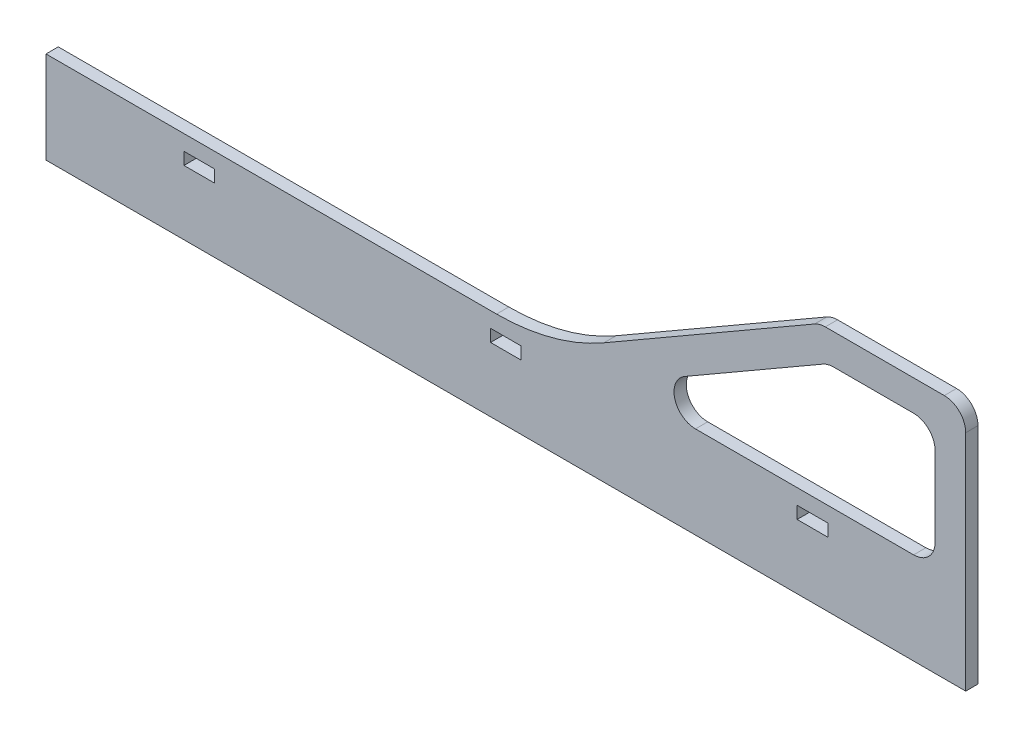
ISO-10303-21;
HEADER;
FILE_DESCRIPTION(('STEP AP214'),'2;1');
FILE_NAME('part.step','',(''),(''),'','','');
FILE_SCHEMA(('AUTOMOTIVE_DESIGN { 1 0 10303 214 1 1 1 1 }'));
ENDSEC;
DATA;
#1=APPLICATION_CONTEXT('core data for automotive mechanical design processes');
#2=APPLICATION_PROTOCOL_DEFINITION('international standard','automotive_design',2000,#1);
#3=PRODUCT_CONTEXT('',#1,'mechanical');
#4=PRODUCT('Part','Part','',(#3));
#5=PRODUCT_RELATED_PRODUCT_CATEGORY('part','',(#4));
#6=PRODUCT_DEFINITION_FORMATION('','',#4);
#7=PRODUCT_DEFINITION_CONTEXT('part definition',#1,'design');
#8=PRODUCT_DEFINITION('design','',#6,#7);
#9=PRODUCT_DEFINITION_SHAPE('','',#8);
#10=(LENGTH_UNIT() NAMED_UNIT(*) SI_UNIT(.MILLI.,.METRE.));
#11=(NAMED_UNIT(*) PLANE_ANGLE_UNIT() SI_UNIT($,.RADIAN.));
#12=(NAMED_UNIT(*) SI_UNIT($,.STERADIAN.) SOLID_ANGLE_UNIT());
#13=UNCERTAINTY_MEASURE_WITH_UNIT(LENGTH_MEASURE(1.E-05),#10,'distance_accuracy_value','');
#14=(GEOMETRIC_REPRESENTATION_CONTEXT(3) GLOBAL_UNCERTAINTY_ASSIGNED_CONTEXT((#13)) GLOBAL_UNIT_ASSIGNED_CONTEXT((#10,
#11,#12)) REPRESENTATION_CONTEXT('',''));
#15=CARTESIAN_POINT('',(0.,0.,0.));
#16=DIRECTION('',(0.,0.,1.));
#17=DIRECTION('',(1.,0.,0.));
#18=AXIS2_PLACEMENT_3D('',#15,#16,#17);
#19=CARTESIAN_POINT('',(546.959107885458,100.,4.));
#20=DIRECTION('',(0.,0.,-1.));
#21=DIRECTION('',(-1.,0.,0.));
#22=AXIS2_PLACEMENT_3D('',#19,#20,#21);
#23=PLANE('',#22);
#24=DIRECTION('',(0.,-1.,0.));
#25=VECTOR('',#24,1.);
#26=CARTESIAN_POINT('',(645.,21.,4.));
#27=LINE('',#26,#25);
#28=CARTESIAN_POINT('',(645.,25.0000000000028,4.));
#29=VERTEX_POINT('',#28);
#30=CARTESIAN_POINT('',(645.,21.,4.));
#31=VERTEX_POINT('',#30);
#32=EDGE_CURVE('E288',#29,#31,#27,.T.);
#33=ORIENTED_EDGE('',*,*,#32,.F.);
#34=DIRECTION('',(-1.,0.,0.));
#35=VECTOR('',#34,1.);
#36=CARTESIAN_POINT('',(645.,25.0000000000028,4.));
#37=LINE('',#36,#35);
#38=CARTESIAN_POINT('',(655.,25.0000000000028,4.));
#39=VERTEX_POINT('',#38);
#40=EDGE_CURVE('E296',#39,#29,#37,.T.);
#41=ORIENTED_EDGE('',*,*,#40,.F.);
#42=DIRECTION('',(0.,1.,0.));
#43=VECTOR('',#42,1.);
#44=CARTESIAN_POINT('',(655.,21.,4.));
#45=LINE('',#44,#43);
#46=CARTESIAN_POINT('',(655.,21.,4.));
#47=VERTEX_POINT('',#46);
#48=EDGE_CURVE('E293',#47,#39,#45,.T.);
#49=ORIENTED_EDGE('',*,*,#48,.F.);
#50=DIRECTION('',(1.,0.,0.));
#51=VECTOR('',#50,1.);
#52=CARTESIAN_POINT('',(645.,21.,4.));
#53=LINE('',#52,#51);
#54=EDGE_CURVE('E290',#31,#47,#53,.T.);
#55=ORIENTED_EDGE('',*,*,#54,.F.);
#56=EDGE_LOOP('',(#33,#41,#49,#55));
#57=FACE_BOUND('',#56,.T.);
#58=DIRECTION('',(0.,-1.,0.));
#59=VECTOR('',#58,1.);
#60=CARTESIAN_POINT('',(445.,21.,4.));
#61=LINE('',#60,#59);
#62=CARTESIAN_POINT('',(445.,25.,4.));
#63=VERTEX_POINT('',#62);
#64=CARTESIAN_POINT('',(445.,21.,4.));
#65=VERTEX_POINT('',#64);
#66=EDGE_CURVE('E350',#63,#65,#61,.T.);
#67=ORIENTED_EDGE('',*,*,#66,.F.);
#68=DIRECTION('',(-1.,0.,0.));
#69=VECTOR('',#68,1.);
#70=CARTESIAN_POINT('',(445.,25.,4.));
#71=LINE('',#70,#69);
#72=CARTESIAN_POINT('',(455.,25.,4.));
#73=VERTEX_POINT('',#72);
#74=EDGE_CURVE('E358',#73,#63,#71,.T.);
#75=ORIENTED_EDGE('',*,*,#74,.F.);
#76=DIRECTION('',(0.,1.,0.));
#77=VECTOR('',#76,1.);
#78=CARTESIAN_POINT('',(455.,21.,4.));
#79=LINE('',#78,#77);
#80=CARTESIAN_POINT('',(455.,21.,4.));
#81=VERTEX_POINT('',#80);
#82=EDGE_CURVE('E355',#81,#73,#79,.T.);
#83=ORIENTED_EDGE('',*,*,#82,.F.);
#84=DIRECTION('',(1.,0.,0.));
#85=VECTOR('',#84,1.);
#86=CARTESIAN_POINT('',(445.,21.,4.));
#87=LINE('',#86,#85);
#88=EDGE_CURVE('E352',#65,#81,#87,.T.);
#89=ORIENTED_EDGE('',*,*,#88,.F.);
#90=EDGE_LOOP('',(#67,#75,#83,#89));
#91=FACE_BOUND('',#90,.T.);
#92=DIRECTION('',(0.,1.,0.));
#93=VECTOR('',#92,1.);
#94=CARTESIAN_POINT('',(700.,73.,4.));
#95=LINE('',#94,#93);
#96=CARTESIAN_POINT('',(700.,0.,4.));
#97=VERTEX_POINT('',#96);
#98=CARTESIAN_POINT('',(700.,73.,4.));
#99=VERTEX_POINT('',#98);
#100=EDGE_CURVE('E381',#97,#99,#95,.T.);
#101=ORIENTED_EDGE('',*,*,#100,.T.);
#102=CARTESIAN_POINT('',(693.,73.,4.));
#103=DIRECTION('',(0.,0.,1.));
#104=DIRECTION('',(-1.,0.,0.));
#105=AXIS2_PLACEMENT_3D('',#102,#103,#104);
#106=CIRCLE('',#105,7.00000000000001);
#107=CARTESIAN_POINT('',(693.,80.,4.));
#108=VERTEX_POINT('',#107);
#109=EDGE_CURVE('E384',#99,#108,#106,.T.);
#110=ORIENTED_EDGE('',*,*,#109,.T.);
#111=DIRECTION('',(-1.,0.,0.));
#112=VECTOR('',#111,1.);
#113=CARTESIAN_POINT('',(654.193736081099,80.,4.));
#114=LINE('',#113,#112);
#115=CARTESIAN_POINT('',(654.193736081099,80.,4.));
#116=VERTEX_POINT('',#115);
#117=EDGE_CURVE('E387',#108,#116,#114,.T.);
#118=ORIENTED_EDGE('',*,*,#117,.T.);
#119=CARTESIAN_POINT('',(654.193736081099,73.,4.));
#120=DIRECTION('',(0.,0.,1.));
#121=DIRECTION('',(1.,0.,0.));
#122=AXIS2_PLACEMENT_3D('',#119,#120,#121);
#123=CIRCLE('',#122,7.);
#124=CARTESIAN_POINT('',(650.693736081099,79.0621778264911,4.));
#125=VERTEX_POINT('',#124);
#126=EDGE_CURVE('E389',#116,#125,#123,.T.);
#127=ORIENTED_EDGE('',*,*,#126,.T.);
#128=DIRECTION('',(-0.866025403784442,-0.499999999999995,0.));
#129=VECTOR('',#128,1.);
#130=CARTESIAN_POINT('',(650.693736081099,79.0621778264911,4.));
#131=LINE('',#130,#129);
#132=CARTESIAN_POINT('',(581.959107885458,39.3782217350892,4.));
#133=VERTEX_POINT('',#132);
#134=EDGE_CURVE('E391',#125,#133,#131,.T.);
#135=ORIENTED_EDGE('',*,*,#134,.T.);
#136=CARTESIAN_POINT('',(546.959107885458,100.,4.));
#137=DIRECTION('',(0.,0.,-1.));
#138=DIRECTION('',(-1.,0.,0.));
#139=AXIS2_PLACEMENT_3D('',#136,#137,#138);
#140=CIRCLE('',#139,70.);
#141=CARTESIAN_POINT('',(546.959107885458,30.,4.));
#142=VERTEX_POINT('',#141);
#143=EDGE_CURVE('E393',#133,#142,#140,.T.);
#144=ORIENTED_EDGE('',*,*,#143,.T.);
#145=DIRECTION('',(-1.,0.,0.));
#146=VECTOR('',#145,1.);
#147=CARTESIAN_POINT('',(400.,30.,4.));
#148=LINE('',#147,#146);
#149=CARTESIAN_POINT('',(400.,30.,4.));
#150=VERTEX_POINT('',#149);
#151=EDGE_CURVE('E395',#142,#150,#148,.T.);
#152=ORIENTED_EDGE('',*,*,#151,.T.);
#153=DIRECTION('',(0.,-1.,0.));
#154=VECTOR('',#153,1.);
#155=CARTESIAN_POINT('',(400.,30.,4.));
#156=LINE('',#155,#154);
#157=CARTESIAN_POINT('',(400.,0.,4.));
#158=VERTEX_POINT('',#157);
#159=EDGE_CURVE('E397',#150,#158,#156,.T.);
#160=ORIENTED_EDGE('',*,*,#159,.T.);
#161=DIRECTION('',(1.,0.,0.));
#162=VECTOR('',#161,1.);
#163=CARTESIAN_POINT('',(400.,0.,4.));
#164=LINE('',#163,#162);
#165=EDGE_CURVE('E399',#158,#97,#164,.T.);
#166=ORIENTED_EDGE('',*,*,#165,.T.);
#167=EDGE_LOOP('',(#101,#110,#118,#127,#135,#144,#152,#160,#166));
#168=FACE_BOUND('',#167,.T.);
#169=DIRECTION('',(0.,-1.,0.));
#170=VECTOR('',#169,1.);
#171=CARTESIAN_POINT('',(545.,21.,4.));
#172=LINE('',#171,#170);
#173=CARTESIAN_POINT('',(545.,25.0000000000028,4.));
#174=VERTEX_POINT('',#173);
#175=CARTESIAN_POINT('',(545.,21.,4.));
#176=VERTEX_POINT('',#175);
#177=EDGE_CURVE('E319',#174,#176,#172,.T.);
#178=ORIENTED_EDGE('',*,*,#177,.F.);
#179=DIRECTION('',(-1.,0.,0.));
#180=VECTOR('',#179,1.);
#181=CARTESIAN_POINT('',(545.,25.0000000000028,4.));
#182=LINE('',#181,#180);
#183=CARTESIAN_POINT('',(555.,25.0000000000028,4.));
#184=VERTEX_POINT('',#183);
#185=EDGE_CURVE('E327',#184,#174,#182,.T.);
#186=ORIENTED_EDGE('',*,*,#185,.F.);
#187=DIRECTION('',(0.,1.,0.));
#188=VECTOR('',#187,1.);
#189=CARTESIAN_POINT('',(555.,21.,4.));
#190=LINE('',#189,#188);
#191=CARTESIAN_POINT('',(555.,21.,4.));
#192=VERTEX_POINT('',#191);
#193=EDGE_CURVE('E324',#192,#184,#190,.T.);
#194=ORIENTED_EDGE('',*,*,#193,.F.);
#195=DIRECTION('',(1.,0.,0.));
#196=VECTOR('',#195,1.);
#197=CARTESIAN_POINT('',(545.,21.,4.));
#198=LINE('',#197,#196);
#199=EDGE_CURVE('E321',#176,#192,#198,.T.);
#200=ORIENTED_EDGE('',*,*,#199,.F.);
#201=EDGE_LOOP('',(#178,#186,#194,#200));
#202=FACE_BOUND('',#201,.T.);
#203=CARTESIAN_POINT('',(611.839907008619,37.,4.));
#204=DIRECTION('',(0.,0.,1.));
#205=DIRECTION('',(-1.,0.,0.));
#206=AXIS2_PLACEMENT_3D('',#203,#204,#205);
#207=CIRCLE('',#206,6.99999999999999);
#208=CARTESIAN_POINT('',(608.33990700862,43.0621778264913,4.));
#209=VERTEX_POINT('',#208);
#210=CARTESIAN_POINT('',(611.83990700862,30.,4.));
#211=VERTEX_POINT('',#210);
#212=EDGE_CURVE('E223',#209,#211,#207,.T.);
#213=ORIENTED_EDGE('',*,*,#212,.F.);
#214=DIRECTION('',(-0.866025403784442,-0.499999999999995,0.));
#215=VECTOR('',#214,1.);
#216=CARTESIAN_POINT('',(653.373228005411,69.0621778264911,4.));
#217=LINE('',#216,#215);
#218=CARTESIAN_POINT('',(653.373228005411,69.0621778264911,4.));
#219=VERTEX_POINT('',#218);
#220=EDGE_CURVE('E256',#219,#209,#217,.T.);
#221=ORIENTED_EDGE('',*,*,#220,.F.);
#222=CARTESIAN_POINT('',(656.873228005411,63.,4.));
#223=DIRECTION('',(0.,0.,1.));
#224=DIRECTION('',(1.,0.,0.));
#225=AXIS2_PLACEMENT_3D('',#222,#223,#224);
#226=CIRCLE('',#225,7.);
#227=CARTESIAN_POINT('',(656.873228005411,70.,4.));
#228=VERTEX_POINT('',#227);
#229=EDGE_CURVE('E254',#228,#219,#226,.T.);
#230=ORIENTED_EDGE('',*,*,#229,.F.);
#231=DIRECTION('',(-1.,0.,0.));
#232=VECTOR('',#231,1.);
#233=CARTESIAN_POINT('',(656.873228005411,70.,4.));
#234=LINE('',#233,#232);
#235=CARTESIAN_POINT('',(683.,70.,4.));
#236=VERTEX_POINT('',#235);
#237=EDGE_CURVE('E252',#236,#228,#234,.T.);
#238=ORIENTED_EDGE('',*,*,#237,.F.);
#239=CARTESIAN_POINT('',(683.,63.,4.));
#240=DIRECTION('',(0.,0.,1.));
#241=DIRECTION('',(1.,0.,0.));
#242=AXIS2_PLACEMENT_3D('',#239,#240,#241);
#243=CIRCLE('',#242,7.00000000000001);
#244=CARTESIAN_POINT('',(690.,63.,4.));
#245=VERTEX_POINT('',#244);
#246=EDGE_CURVE('E250',#245,#236,#243,.T.);
#247=ORIENTED_EDGE('',*,*,#246,.F.);
#248=DIRECTION('',(0.,1.,0.));
#249=VECTOR('',#248,1.);
#250=CARTESIAN_POINT('',(690.,63.,4.));
#251=LINE('',#250,#249);
#252=CARTESIAN_POINT('',(690.,37.,4.));
#253=VERTEX_POINT('',#252);
#254=EDGE_CURVE('E246',#253,#245,#251,.T.);
#255=ORIENTED_EDGE('',*,*,#254,.F.);
#256=CARTESIAN_POINT('',(683.,37.,4.));
#257=DIRECTION('',(0.,0.,1.));
#258=DIRECTION('',(1.,0.,0.));
#259=AXIS2_PLACEMENT_3D('',#256,#257,#258);
#260=CIRCLE('',#259,7.);
#261=CARTESIAN_POINT('',(683.,30.,4.));
#262=VERTEX_POINT('',#261);
#263=EDGE_CURVE('E244',#262,#253,#260,.T.);
#264=ORIENTED_EDGE('',*,*,#263,.F.);
#265=DIRECTION('',(1.,0.,0.));
#266=VECTOR('',#265,1.);
#267=CARTESIAN_POINT('',(611.83990700862,30.,4.));
#268=LINE('',#267,#266);
#269=EDGE_CURVE('E231',#211,#262,#268,.T.);
#270=ORIENTED_EDGE('',*,*,#269,.F.);
#271=EDGE_LOOP('',(#213,#221,#230,#238,#247,#255,#264,#270));
#272=FACE_BOUND('',#271,.T.);
#273=ADVANCED_FACE('F32',(#57,#91,#168,#202,#272),#23,.F.);
#274=CARTESIAN_POINT('',(546.959107885458,100.,0.));
#275=DIRECTION('',(0.,0.,-1.));
#276=DIRECTION('',(-1.,0.,0.));
#277=AXIS2_PLACEMENT_3D('',#274,#275,#276);
#278=PLANE('',#277);
#279=DIRECTION('',(-1.,0.,0.));
#280=VECTOR('',#279,1.);
#281=CARTESIAN_POINT('',(645.,25.0000000000028,0.));
#282=LINE('',#281,#280);
#283=CARTESIAN_POINT('',(655.,25.0000000000028,0.));
#284=VERTEX_POINT('',#283);
#285=CARTESIAN_POINT('',(645.,25.0000000000028,0.));
#286=VERTEX_POINT('',#285);
#287=EDGE_CURVE('E291',#284,#286,#282,.T.);
#288=ORIENTED_EDGE('',*,*,#287,.T.);
#289=DIRECTION('',(0.,-1.,0.));
#290=VECTOR('',#289,1.);
#291=CARTESIAN_POINT('',(645.,21.,0.));
#292=LINE('',#291,#290);
#293=CARTESIAN_POINT('',(645.,21.,0.));
#294=VERTEX_POINT('',#293);
#295=EDGE_CURVE('E239',#286,#294,#292,.T.);
#296=ORIENTED_EDGE('',*,*,#295,.T.);
#297=DIRECTION('',(1.,0.,0.));
#298=VECTOR('',#297,1.);
#299=CARTESIAN_POINT('',(645.,21.,0.));
#300=LINE('',#299,#298);
#301=CARTESIAN_POINT('',(655.,21.,0.));
#302=VERTEX_POINT('',#301);
#303=EDGE_CURVE('E301',#294,#302,#300,.T.);
#304=ORIENTED_EDGE('',*,*,#303,.T.);
#305=DIRECTION('',(0.,1.,0.));
#306=VECTOR('',#305,1.);
#307=CARTESIAN_POINT('',(655.,21.,0.));
#308=LINE('',#307,#306);
#309=EDGE_CURVE('E304',#302,#284,#308,.T.);
#310=ORIENTED_EDGE('',*,*,#309,.T.);
#311=EDGE_LOOP('',(#288,#296,#304,#310));
#312=FACE_BOUND('',#311,.T.);
#313=DIRECTION('',(-1.,0.,0.));
#314=VECTOR('',#313,1.);
#315=CARTESIAN_POINT('',(445.,25.,0.));
#316=LINE('',#315,#314);
#317=CARTESIAN_POINT('',(455.,25.,0.));
#318=VERTEX_POINT('',#317);
#319=CARTESIAN_POINT('',(445.,25.,0.));
#320=VERTEX_POINT('',#319);
#321=EDGE_CURVE('E353',#318,#320,#316,.T.);
#322=ORIENTED_EDGE('',*,*,#321,.T.);
#323=DIRECTION('',(0.,-1.,0.));
#324=VECTOR('',#323,1.);
#325=CARTESIAN_POINT('',(445.,21.,0.));
#326=LINE('',#325,#324);
#327=CARTESIAN_POINT('',(445.,21.,0.));
#328=VERTEX_POINT('',#327);
#329=EDGE_CURVE('E349',#320,#328,#326,.T.);
#330=ORIENTED_EDGE('',*,*,#329,.T.);
#331=DIRECTION('',(1.,0.,0.));
#332=VECTOR('',#331,1.);
#333=CARTESIAN_POINT('',(445.,21.,0.));
#334=LINE('',#333,#332);
#335=CARTESIAN_POINT('',(455.,21.,0.));
#336=VERTEX_POINT('',#335);
#337=EDGE_CURVE('E363',#328,#336,#334,.T.);
#338=ORIENTED_EDGE('',*,*,#337,.T.);
#339=DIRECTION('',(0.,1.,0.));
#340=VECTOR('',#339,1.);
#341=CARTESIAN_POINT('',(455.,21.,0.));
#342=LINE('',#341,#340);
#343=EDGE_CURVE('E366',#336,#318,#342,.T.);
#344=ORIENTED_EDGE('',*,*,#343,.T.);
#345=EDGE_LOOP('',(#322,#330,#338,#344));
#346=FACE_BOUND('',#345,.T.);
#347=CARTESIAN_POINT('',(693.,73.,0.));
#348=DIRECTION('',(0.,0.,1.));
#349=DIRECTION('',(-1.,0.,0.));
#350=AXIS2_PLACEMENT_3D('',#347,#348,#349);
#351=CIRCLE('',#350,7.00000000000001);
#352=CARTESIAN_POINT('',(700.,73.,0.));
#353=VERTEX_POINT('',#352);
#354=CARTESIAN_POINT('',(693.,80.,0.));
#355=VERTEX_POINT('',#354);
#356=EDGE_CURVE('E380',#353,#355,#351,.T.);
#357=ORIENTED_EDGE('',*,*,#356,.F.);
#358=DIRECTION('',(0.,1.,0.));
#359=VECTOR('',#358,1.);
#360=CARTESIAN_POINT('',(700.,0.,0.));
#361=LINE('',#360,#359);
#362=CARTESIAN_POINT('',(700.,0.,0.));
#363=VERTEX_POINT('',#362);
#364=EDGE_CURVE('E385',#363,#353,#361,.T.);
#365=ORIENTED_EDGE('',*,*,#364,.F.);
#366=DIRECTION('',(1.,0.,0.));
#367=VECTOR('',#366,1.);
#368=CARTESIAN_POINT('',(400.,0.,0.));
#369=LINE('',#368,#367);
#370=CARTESIAN_POINT('',(400.,0.,0.));
#371=VERTEX_POINT('',#370);
#372=EDGE_CURVE('E416',#371,#363,#369,.T.);
#373=ORIENTED_EDGE('',*,*,#372,.F.);
#374=DIRECTION('',(0.,-1.,0.));
#375=VECTOR('',#374,1.);
#376=CARTESIAN_POINT('',(400.,30.,0.));
#377=LINE('',#376,#375);
#378=CARTESIAN_POINT('',(400.,30.,0.));
#379=VERTEX_POINT('',#378);
#380=EDGE_CURVE('E414',#379,#371,#377,.T.);
#381=ORIENTED_EDGE('',*,*,#380,.F.);
#382=DIRECTION('',(-1.,0.,0.));
#383=VECTOR('',#382,1.);
#384=CARTESIAN_POINT('',(400.,30.,0.));
#385=LINE('',#384,#383);
#386=CARTESIAN_POINT('',(546.959107885458,30.,0.));
#387=VERTEX_POINT('',#386);
#388=EDGE_CURVE('E412',#387,#379,#385,.T.);
#389=ORIENTED_EDGE('',*,*,#388,.F.);
#390=CARTESIAN_POINT('',(546.959107885458,100.,0.));
#391=DIRECTION('',(0.,0.,-1.));
#392=DIRECTION('',(-1.,0.,0.));
#393=AXIS2_PLACEMENT_3D('',#390,#391,#392);
#394=CIRCLE('',#393,70.);
#395=CARTESIAN_POINT('',(581.959107885458,39.3782217350892,0.));
#396=VERTEX_POINT('',#395);
#397=EDGE_CURVE('E410',#396,#387,#394,.T.);
#398=ORIENTED_EDGE('',*,*,#397,.F.);
#399=DIRECTION('',(-0.866025403784442,-0.499999999999995,0.));
#400=VECTOR('',#399,1.);
#401=CARTESIAN_POINT('',(650.693736081099,79.0621778264911,0.));
#402=LINE('',#401,#400);
#403=CARTESIAN_POINT('',(650.693736081099,79.0621778264911,0.));
#404=VERTEX_POINT('',#403);
#405=EDGE_CURVE('E408',#404,#396,#402,.T.);
#406=ORIENTED_EDGE('',*,*,#405,.F.);
#407=CARTESIAN_POINT('',(654.193736081099,73.,0.));
#408=DIRECTION('',(0.,0.,1.));
#409=DIRECTION('',(1.,0.,0.));
#410=AXIS2_PLACEMENT_3D('',#407,#408,#409);
#411=CIRCLE('',#410,7.);
#412=CARTESIAN_POINT('',(654.193736081099,80.,0.));
#413=VERTEX_POINT('',#412);
#414=EDGE_CURVE('E406',#413,#404,#411,.T.);
#415=ORIENTED_EDGE('',*,*,#414,.F.);
#416=DIRECTION('',(-1.,0.,0.));
#417=VECTOR('',#416,1.);
#418=CARTESIAN_POINT('',(654.193736081099,80.,0.));
#419=LINE('',#418,#417);
#420=EDGE_CURVE('E404',#355,#413,#419,.T.);
#421=ORIENTED_EDGE('',*,*,#420,.F.);
#422=EDGE_LOOP('',(#357,#365,#373,#381,#389,#398,#406,#415,#421));
#423=FACE_BOUND('',#422,.T.);
#424=DIRECTION('',(-1.,0.,0.));
#425=VECTOR('',#424,1.);
#426=CARTESIAN_POINT('',(545.,25.0000000000028,0.));
#427=LINE('',#426,#425);
#428=CARTESIAN_POINT('',(555.,25.0000000000028,0.));
#429=VERTEX_POINT('',#428);
#430=CARTESIAN_POINT('',(545.,25.0000000000028,0.));
#431=VERTEX_POINT('',#430);
#432=EDGE_CURVE('E322',#429,#431,#427,.T.);
#433=ORIENTED_EDGE('',*,*,#432,.T.);
#434=DIRECTION('',(0.,-1.,0.));
#435=VECTOR('',#434,1.);
#436=CARTESIAN_POINT('',(545.,21.,0.));
#437=LINE('',#436,#435);
#438=CARTESIAN_POINT('',(545.,21.,0.));
#439=VERTEX_POINT('',#438);
#440=EDGE_CURVE('E318',#431,#439,#437,.T.);
#441=ORIENTED_EDGE('',*,*,#440,.T.);
#442=DIRECTION('',(1.,0.,0.));
#443=VECTOR('',#442,1.);
#444=CARTESIAN_POINT('',(545.,21.,0.));
#445=LINE('',#444,#443);
#446=CARTESIAN_POINT('',(555.,21.,0.));
#447=VERTEX_POINT('',#446);
#448=EDGE_CURVE('E332',#439,#447,#445,.T.);
#449=ORIENTED_EDGE('',*,*,#448,.T.);
#450=DIRECTION('',(0.,1.,0.));
#451=VECTOR('',#450,1.);
#452=CARTESIAN_POINT('',(555.,21.,0.));
#453=LINE('',#452,#451);
#454=EDGE_CURVE('E335',#447,#429,#453,.T.);
#455=ORIENTED_EDGE('',*,*,#454,.T.);
#456=EDGE_LOOP('',(#433,#441,#449,#455));
#457=FACE_BOUND('',#456,.T.);
#458=DIRECTION('',(-0.866025403784442,-0.499999999999995,0.));
#459=VECTOR('',#458,1.);
#460=CARTESIAN_POINT('',(653.373228005411,69.0621778264911,0.));
#461=LINE('',#460,#459);
#462=CARTESIAN_POINT('',(653.373228005411,69.0621778264911,0.));
#463=VERTEX_POINT('',#462);
#464=CARTESIAN_POINT('',(608.33990700862,43.0621778264913,0.));
#465=VERTEX_POINT('',#464);
#466=EDGE_CURVE('E232',#463,#465,#461,.T.);
#467=ORIENTED_EDGE('',*,*,#466,.T.);
#468=CARTESIAN_POINT('',(611.839907008619,37.,0.));
#469=DIRECTION('',(0.,0.,1.));
#470=DIRECTION('',(-1.,0.,0.));
#471=AXIS2_PLACEMENT_3D('',#468,#469,#470);
#472=CIRCLE('',#471,6.99999999999999);
#473=CARTESIAN_POINT('',(611.83990700862,30.,0.));
#474=VERTEX_POINT('',#473);
#475=EDGE_CURVE('E55',#465,#474,#472,.T.);
#476=ORIENTED_EDGE('',*,*,#475,.T.);
#477=DIRECTION('',(1.,0.,0.));
#478=VECTOR('',#477,1.);
#479=CARTESIAN_POINT('',(611.83990700862,30.,0.));
#480=LINE('',#479,#478);
#481=CARTESIAN_POINT('',(683.,30.,0.));
#482=VERTEX_POINT('',#481);
#483=EDGE_CURVE('E238',#474,#482,#480,.T.);
#484=ORIENTED_EDGE('',*,*,#483,.T.);
#485=CARTESIAN_POINT('',(683.,37.,0.));
#486=DIRECTION('',(0.,0.,1.));
#487=DIRECTION('',(1.,0.,0.));
#488=AXIS2_PLACEMENT_3D('',#485,#486,#487);
#489=CIRCLE('',#488,7.);
#490=CARTESIAN_POINT('',(690.,37.,0.));
#491=VERTEX_POINT('',#490);
#492=EDGE_CURVE('E260',#482,#491,#489,.T.);
#493=ORIENTED_EDGE('',*,*,#492,.T.);
#494=DIRECTION('',(0.,1.,0.));
#495=VECTOR('',#494,1.);
#496=CARTESIAN_POINT('',(690.,63.,0.));
#497=LINE('',#496,#495);
#498=CARTESIAN_POINT('',(690.,63.,0.));
#499=VERTEX_POINT('',#498);
#500=EDGE_CURVE('E263',#491,#499,#497,.T.);
#501=ORIENTED_EDGE('',*,*,#500,.T.);
#502=CARTESIAN_POINT('',(683.,63.,0.));
#503=DIRECTION('',(0.,0.,1.));
#504=DIRECTION('',(1.,0.,0.));
#505=AXIS2_PLACEMENT_3D('',#502,#503,#504);
#506=CIRCLE('',#505,7.00000000000001);
#507=CARTESIAN_POINT('',(683.,70.,0.));
#508=VERTEX_POINT('',#507);
#509=EDGE_CURVE('E266',#499,#508,#506,.T.);
#510=ORIENTED_EDGE('',*,*,#509,.T.);
#511=DIRECTION('',(-1.,0.,0.));
#512=VECTOR('',#511,1.);
#513=CARTESIAN_POINT('',(656.873228005411,70.,0.));
#514=LINE('',#513,#512);
#515=CARTESIAN_POINT('',(656.873228005411,70.,0.));
#516=VERTEX_POINT('',#515);
#517=EDGE_CURVE('E269',#508,#516,#514,.T.);
#518=ORIENTED_EDGE('',*,*,#517,.T.);
#519=CARTESIAN_POINT('',(656.873228005411,63.,0.));
#520=DIRECTION('',(0.,0.,1.));
#521=DIRECTION('',(1.,0.,0.));
#522=AXIS2_PLACEMENT_3D('',#519,#520,#521);
#523=CIRCLE('',#522,7.);
#524=EDGE_CURVE('E272',#516,#463,#523,.T.);
#525=ORIENTED_EDGE('',*,*,#524,.T.);
#526=EDGE_LOOP('',(#467,#476,#484,#493,#501,#510,#518,#525));
#527=FACE_BOUND('',#526,.T.);
#528=ADVANCED_FACE('F449',(#312,#346,#423,#457,#527),#278,.T.);
#529=CARTESIAN_POINT('',(693.,73.,4.));
#530=DIRECTION('',(0.,0.,-1.));
#531=DIRECTION('',(-1.,0.,0.));
#532=AXIS2_PLACEMENT_3D('',#529,#530,#531);
#533=CYLINDRICAL_SURFACE('',#532,7.00000000000001);
#534=ORIENTED_EDGE('',*,*,#356,.T.);
#535=DIRECTION('',(0.,0.,-1.));
#536=VECTOR('',#535,1.);
#537=CARTESIAN_POINT('',(693.,80.,4.));
#538=LINE('',#537,#536);
#539=EDGE_CURVE('E40',#108,#355,#538,.T.);
#540=ORIENTED_EDGE('',*,*,#539,.F.);
#541=ORIENTED_EDGE('',*,*,#109,.F.);
#542=DIRECTION('',(0.,0.,-1.));
#543=VECTOR('',#542,1.);
#544=CARTESIAN_POINT('',(700.,73.,4.));
#545=LINE('',#544,#543);
#546=EDGE_CURVE('E11',#99,#353,#545,.T.);
#547=ORIENTED_EDGE('',*,*,#546,.T.);
#548=EDGE_LOOP('',(#534,#540,#541,#547));
#549=FACE_BOUND('',#548,.T.);
#550=ADVANCED_FACE('F34',(#549),#533,.T.);
#551=CARTESIAN_POINT('',(654.193736081099,80.,4.));
#552=DIRECTION('',(0.,-1.,0.));
#553=DIRECTION('',(0.,0.,-1.));
#554=AXIS2_PLACEMENT_3D('',#551,#552,#553);
#555=PLANE('',#554);
#556=ORIENTED_EDGE('',*,*,#420,.T.);
#557=DIRECTION('',(0.,0.,-1.));
#558=VECTOR('',#557,1.);
#559=CARTESIAN_POINT('',(654.193736081099,80.,4.));
#560=LINE('',#559,#558);
#561=EDGE_CURVE('E436',#116,#413,#560,.T.);
#562=ORIENTED_EDGE('',*,*,#561,.F.);
#563=ORIENTED_EDGE('',*,*,#117,.F.);
#564=ORIENTED_EDGE('',*,*,#539,.T.);
#565=EDGE_LOOP('',(#556,#562,#563,#564));
#566=FACE_BOUND('',#565,.T.);
#567=ADVANCED_FACE('F443',(#566),#555,.F.);
#568=CARTESIAN_POINT('',(654.193736081099,73.,4.));
#569=DIRECTION('',(0.,0.,-1.));
#570=DIRECTION('',(-1.,0.,0.));
#571=AXIS2_PLACEMENT_3D('',#568,#569,#570);
#572=CYLINDRICAL_SURFACE('',#571,7.);
#573=ORIENTED_EDGE('',*,*,#414,.T.);
#574=DIRECTION('',(0.,0.,-1.));
#575=VECTOR('',#574,1.);
#576=CARTESIAN_POINT('',(650.693736081099,79.0621778264911,4.));
#577=LINE('',#576,#575);
#578=EDGE_CURVE('E433',#125,#404,#577,.T.);
#579=ORIENTED_EDGE('',*,*,#578,.F.);
#580=ORIENTED_EDGE('',*,*,#126,.F.);
#581=ORIENTED_EDGE('',*,*,#561,.T.);
#582=EDGE_LOOP('',(#573,#579,#580,#581));
#583=FACE_BOUND('',#582,.T.);
#584=ADVANCED_FACE('F456',(#583),#572,.T.);
#585=CARTESIAN_POINT('',(650.693736081099,79.0621778264911,4.));
#586=DIRECTION('',(0.499999999999995,-0.866025403784442,0.));
#587=DIRECTION('',(0.866025403784442,0.499999999999995,0.));
#588=AXIS2_PLACEMENT_3D('',#585,#586,#587);
#589=PLANE('',#588);
#590=ORIENTED_EDGE('',*,*,#405,.T.);
#591=DIRECTION('',(0.,0.,-1.));
#592=VECTOR('',#591,1.);
#593=CARTESIAN_POINT('',(581.959107885458,39.3782217350892,4.));
#594=LINE('',#593,#592);
#595=EDGE_CURVE('E430',#133,#396,#594,.T.);
#596=ORIENTED_EDGE('',*,*,#595,.F.);
#597=ORIENTED_EDGE('',*,*,#134,.F.);
#598=ORIENTED_EDGE('',*,*,#578,.T.);
#599=EDGE_LOOP('',(#590,#596,#597,#598));
#600=FACE_BOUND('',#599,.T.);
#601=ADVANCED_FACE('F460',(#600),#589,.F.);
#602=CARTESIAN_POINT('',(546.959107885458,100.,4.));
#603=DIRECTION('',(0.,0.,-1.));
#604=DIRECTION('',(-1.,0.,0.));
#605=AXIS2_PLACEMENT_3D('',#602,#603,#604);
#606=CYLINDRICAL_SURFACE('',#605,70.);
#607=ORIENTED_EDGE('',*,*,#397,.T.);
#608=DIRECTION('',(0.,0.,-1.));
#609=VECTOR('',#608,1.);
#610=CARTESIAN_POINT('',(546.959107885458,30.,4.));
#611=LINE('',#610,#609);
#612=EDGE_CURVE('E427',#142,#387,#611,.T.);
#613=ORIENTED_EDGE('',*,*,#612,.F.);
#614=ORIENTED_EDGE('',*,*,#143,.F.);
#615=ORIENTED_EDGE('',*,*,#595,.T.);
#616=EDGE_LOOP('',(#607,#613,#614,#615));
#617=FACE_BOUND('',#616,.T.);
#618=ADVANCED_FACE('F485',(#617),#606,.F.);
#619=CARTESIAN_POINT('',(400.,30.,4.));
#620=DIRECTION('',(0.,-1.,0.));
#621=DIRECTION('',(0.,0.,-1.));
#622=AXIS2_PLACEMENT_3D('',#619,#620,#621);
#623=PLANE('',#622);
#624=ORIENTED_EDGE('',*,*,#388,.T.);
#625=DIRECTION('',(0.,0.,-1.));
#626=VECTOR('',#625,1.);
#627=CARTESIAN_POINT('',(400.,30.,4.));
#628=LINE('',#627,#626);
#629=EDGE_CURVE('E424',#150,#379,#628,.T.);
#630=ORIENTED_EDGE('',*,*,#629,.F.);
#631=ORIENTED_EDGE('',*,*,#151,.F.);
#632=ORIENTED_EDGE('',*,*,#612,.T.);
#633=EDGE_LOOP('',(#624,#630,#631,#632));
#634=FACE_BOUND('',#633,.T.);
#635=ADVANCED_FACE('F483',(#634),#623,.F.);
#636=CARTESIAN_POINT('',(400.,30.,4.));
#637=DIRECTION('',(1.,0.,0.));
#638=DIRECTION('',(0.,0.,-1.));
#639=AXIS2_PLACEMENT_3D('',#636,#637,#638);
#640=PLANE('',#639);
#641=ORIENTED_EDGE('',*,*,#380,.T.);
#642=DIRECTION('',(0.,0.,-1.));
#643=VECTOR('',#642,1.);
#644=CARTESIAN_POINT('',(400.,0.,4.));
#645=LINE('',#644,#643);
#646=EDGE_CURVE('E421',#158,#371,#645,.T.);
#647=ORIENTED_EDGE('',*,*,#646,.F.);
#648=ORIENTED_EDGE('',*,*,#159,.F.);
#649=ORIENTED_EDGE('',*,*,#629,.T.);
#650=EDGE_LOOP('',(#641,#647,#648,#649));
#651=FACE_BOUND('',#650,.T.);
#652=ADVANCED_FACE('F479',(#651),#640,.F.);
#653=CARTESIAN_POINT('',(400.,0.,4.));
#654=DIRECTION('',(0.,1.,0.));
#655=DIRECTION('',(0.,0.,1.));
#656=AXIS2_PLACEMENT_3D('',#653,#654,#655);
#657=PLANE('',#656);
#658=ORIENTED_EDGE('',*,*,#372,.T.);
#659=DIRECTION('',(0.,0.,-1.));
#660=VECTOR('',#659,1.);
#661=CARTESIAN_POINT('',(700.,0.,4.));
#662=LINE('',#661,#660);
#663=EDGE_CURVE('E402',#97,#363,#662,.T.);
#664=ORIENTED_EDGE('',*,*,#663,.F.);
#665=ORIENTED_EDGE('',*,*,#165,.F.);
#666=ORIENTED_EDGE('',*,*,#646,.T.);
#667=EDGE_LOOP('',(#658,#664,#665,#666));
#668=FACE_BOUND('',#667,.T.);
#669=ADVANCED_FACE('F474',(#668),#657,.F.);
#670=CARTESIAN_POINT('',(700.,0.,4.));
#671=DIRECTION('',(-1.,0.,0.));
#672=DIRECTION('',(0.,0.,1.));
#673=AXIS2_PLACEMENT_3D('',#670,#671,#672);
#674=PLANE('',#673);
#675=ORIENTED_EDGE('',*,*,#364,.T.);
#676=ORIENTED_EDGE('',*,*,#546,.F.);
#677=ORIENTED_EDGE('',*,*,#100,.F.);
#678=ORIENTED_EDGE('',*,*,#663,.T.);
#679=EDGE_LOOP('',(#675,#676,#677,#678));
#680=FACE_BOUND('',#679,.T.);
#681=ADVANCED_FACE('F468',(#680),#674,.F.);
#682=CARTESIAN_POINT('',(445.,21.,4.));
#683=DIRECTION('',(1.,0.,0.));
#684=DIRECTION('',(0.,0.,-1.));
#685=AXIS2_PLACEMENT_3D('',#682,#683,#684);
#686=PLANE('',#685);
#687=ORIENTED_EDGE('',*,*,#329,.F.);
#688=DIRECTION('',(0.,0.,-1.));
#689=VECTOR('',#688,1.);
#690=CARTESIAN_POINT('',(445.,25.,4.));
#691=LINE('',#690,#689);
#692=EDGE_CURVE('E360',#63,#320,#691,.T.);
#693=ORIENTED_EDGE('',*,*,#692,.F.);
#694=ORIENTED_EDGE('',*,*,#66,.T.);
#695=DIRECTION('',(0.,0.,-1.));
#696=VECTOR('',#695,1.);
#697=CARTESIAN_POINT('',(445.,21.,4.));
#698=LINE('',#697,#696);
#699=EDGE_CURVE('E377',#65,#328,#698,.T.);
#700=ORIENTED_EDGE('',*,*,#699,.T.);
#701=EDGE_LOOP('',(#687,#693,#694,#700));
#702=FACE_BOUND('',#701,.T.);
#703=ADVANCED_FACE('F505',(#702),#686,.T.);
#704=CARTESIAN_POINT('',(445.,21.,4.));
#705=DIRECTION('',(0.,1.,0.));
#706=DIRECTION('',(-1.,0.,0.));
#707=AXIS2_PLACEMENT_3D('',#704,#705,#706);
#708=PLANE('',#707);
#709=ORIENTED_EDGE('',*,*,#337,.F.);
#710=ORIENTED_EDGE('',*,*,#699,.F.);
#711=ORIENTED_EDGE('',*,*,#88,.T.);
#712=DIRECTION('',(0.,0.,-1.));
#713=VECTOR('',#712,1.);
#714=CARTESIAN_POINT('',(455.,21.,4.));
#715=LINE('',#714,#713);
#716=EDGE_CURVE('E375',#81,#336,#715,.T.);
#717=ORIENTED_EDGE('',*,*,#716,.T.);
#718=EDGE_LOOP('',(#709,#710,#711,#717));
#719=FACE_BOUND('',#718,.T.);
#720=ADVANCED_FACE('F531',(#719),#708,.T.);
#721=CARTESIAN_POINT('',(455.,21.,4.));
#722=DIRECTION('',(-1.,0.,0.));
#723=DIRECTION('',(0.,0.,1.));
#724=AXIS2_PLACEMENT_3D('',#721,#722,#723);
#725=PLANE('',#724);
#726=ORIENTED_EDGE('',*,*,#343,.F.);
#727=ORIENTED_EDGE('',*,*,#716,.F.);
#728=ORIENTED_EDGE('',*,*,#82,.T.);
#729=DIRECTION('',(0.,0.,-1.));
#730=VECTOR('',#729,1.);
#731=CARTESIAN_POINT('',(455.,25.,4.));
#732=LINE('',#731,#730);
#733=EDGE_CURVE('E373',#73,#318,#732,.T.);
#734=ORIENTED_EDGE('',*,*,#733,.T.);
#735=EDGE_LOOP('',(#726,#727,#728,#734));
#736=FACE_BOUND('',#735,.T.);
#737=ADVANCED_FACE('F538',(#736),#725,.T.);
#738=CARTESIAN_POINT('',(445.,25.,4.));
#739=DIRECTION('',(0.,-1.,0.));
#740=DIRECTION('',(0.,0.,-1.));
#741=AXIS2_PLACEMENT_3D('',#738,#739,#740);
#742=PLANE('',#741);
#743=ORIENTED_EDGE('',*,*,#321,.F.);
#744=ORIENTED_EDGE('',*,*,#733,.F.);
#745=ORIENTED_EDGE('',*,*,#74,.T.);
#746=ORIENTED_EDGE('',*,*,#692,.T.);
#747=EDGE_LOOP('',(#743,#744,#745,#746));
#748=FACE_BOUND('',#747,.T.);
#749=ADVANCED_FACE('F545',(#748),#742,.T.);
#750=CARTESIAN_POINT('',(545.,21.,4.));
#751=DIRECTION('',(1.,0.,0.));
#752=DIRECTION('',(0.,0.,-1.));
#753=AXIS2_PLACEMENT_3D('',#750,#751,#752);
#754=PLANE('',#753);
#755=ORIENTED_EDGE('',*,*,#440,.F.);
#756=DIRECTION('',(0.,0.,-1.));
#757=VECTOR('',#756,1.);
#758=CARTESIAN_POINT('',(545.,25.0000000000028,4.));
#759=LINE('',#758,#757);
#760=EDGE_CURVE('E329',#174,#431,#759,.T.);
#761=ORIENTED_EDGE('',*,*,#760,.F.);
#762=ORIENTED_EDGE('',*,*,#177,.T.);
#763=DIRECTION('',(0.,0.,-1.));
#764=VECTOR('',#763,1.);
#765=CARTESIAN_POINT('',(545.,21.,4.));
#766=LINE('',#765,#764);
#767=EDGE_CURVE('E346',#176,#439,#766,.T.);
#768=ORIENTED_EDGE('',*,*,#767,.T.);
#769=EDGE_LOOP('',(#755,#761,#762,#768));
#770=FACE_BOUND('',#769,.T.);
#771=ADVANCED_FACE('F553',(#770),#754,.T.);
#772=CARTESIAN_POINT('',(545.,21.,4.));
#773=DIRECTION('',(0.,1.,0.));
#774=DIRECTION('',(0.,0.,1.));
#775=AXIS2_PLACEMENT_3D('',#772,#773,#774);
#776=PLANE('',#775);
#777=ORIENTED_EDGE('',*,*,#448,.F.);
#778=ORIENTED_EDGE('',*,*,#767,.F.);
#779=ORIENTED_EDGE('',*,*,#199,.T.);
#780=DIRECTION('',(0.,0.,-1.));
#781=VECTOR('',#780,1.);
#782=CARTESIAN_POINT('',(555.,21.,4.));
#783=LINE('',#782,#781);
#784=EDGE_CURVE('E344',#192,#447,#783,.T.);
#785=ORIENTED_EDGE('',*,*,#784,.T.);
#786=EDGE_LOOP('',(#777,#778,#779,#785));
#787=FACE_BOUND('',#786,.T.);
#788=ADVANCED_FACE('F561',(#787),#776,.T.);
#789=CARTESIAN_POINT('',(555.,21.,4.));
#790=DIRECTION('',(-1.,0.,0.));
#791=DIRECTION('',(0.,0.,1.));
#792=AXIS2_PLACEMENT_3D('',#789,#790,#791);
#793=PLANE('',#792);
#794=ORIENTED_EDGE('',*,*,#454,.F.);
#795=ORIENTED_EDGE('',*,*,#784,.F.);
#796=ORIENTED_EDGE('',*,*,#193,.T.);
#797=DIRECTION('',(0.,0.,-1.));
#798=VECTOR('',#797,1.);
#799=CARTESIAN_POINT('',(555.,25.0000000000028,4.));
#800=LINE('',#799,#798);
#801=EDGE_CURVE('E342',#184,#429,#800,.T.);
#802=ORIENTED_EDGE('',*,*,#801,.T.);
#803=EDGE_LOOP('',(#794,#795,#796,#802));
#804=FACE_BOUND('',#803,.T.);
#805=ADVANCED_FACE('F569',(#804),#793,.T.);
#806=CARTESIAN_POINT('',(545.,25.0000000000028,4.));
#807=DIRECTION('',(0.,-1.,0.));
#808=DIRECTION('',(0.,0.,-1.));
#809=AXIS2_PLACEMENT_3D('',#806,#807,#808);
#810=PLANE('',#809);
#811=ORIENTED_EDGE('',*,*,#432,.F.);
#812=ORIENTED_EDGE('',*,*,#801,.F.);
#813=ORIENTED_EDGE('',*,*,#185,.T.);
#814=ORIENTED_EDGE('',*,*,#760,.T.);
#815=EDGE_LOOP('',(#811,#812,#813,#814));
#816=FACE_BOUND('',#815,.T.);
#817=ADVANCED_FACE('F577',(#816),#810,.T.);
#818=CARTESIAN_POINT('',(645.,21.,4.));
#819=DIRECTION('',(1.,0.,0.));
#820=DIRECTION('',(0.,0.,-1.));
#821=AXIS2_PLACEMENT_3D('',#818,#819,#820);
#822=PLANE('',#821);
#823=ORIENTED_EDGE('',*,*,#295,.F.);
#824=DIRECTION('',(0.,0.,-1.));
#825=VECTOR('',#824,1.);
#826=CARTESIAN_POINT('',(645.,25.0000000000028,4.));
#827=LINE('',#826,#825);
#828=EDGE_CURVE('E298',#29,#286,#827,.T.);
#829=ORIENTED_EDGE('',*,*,#828,.F.);
#830=ORIENTED_EDGE('',*,*,#32,.T.);
#831=DIRECTION('',(0.,0.,-1.));
#832=VECTOR('',#831,1.);
#833=CARTESIAN_POINT('',(645.,21.,4.));
#834=LINE('',#833,#832);
#835=EDGE_CURVE('E315',#31,#294,#834,.T.);
#836=ORIENTED_EDGE('',*,*,#835,.T.);
#837=EDGE_LOOP('',(#823,#829,#830,#836));
#838=FACE_BOUND('',#837,.T.);
#839=ADVANCED_FACE('F585',(#838),#822,.T.);
#840=CARTESIAN_POINT('',(645.,21.,4.));
#841=DIRECTION('',(0.,1.,0.));
#842=DIRECTION('',(0.,0.,1.));
#843=AXIS2_PLACEMENT_3D('',#840,#841,#842);
#844=PLANE('',#843);
#845=ORIENTED_EDGE('',*,*,#303,.F.);
#846=ORIENTED_EDGE('',*,*,#835,.F.);
#847=ORIENTED_EDGE('',*,*,#54,.T.);
#848=DIRECTION('',(0.,0.,-1.));
#849=VECTOR('',#848,1.);
#850=CARTESIAN_POINT('',(655.,21.,4.));
#851=LINE('',#850,#849);
#852=EDGE_CURVE('E313',#47,#302,#851,.T.);
#853=ORIENTED_EDGE('',*,*,#852,.T.);
#854=EDGE_LOOP('',(#845,#846,#847,#853));
#855=FACE_BOUND('',#854,.T.);
#856=ADVANCED_FACE('F593',(#855),#844,.T.);
#857=CARTESIAN_POINT('',(655.,21.,4.));
#858=DIRECTION('',(-1.,0.,0.));
#859=DIRECTION('',(0.,0.,1.));
#860=AXIS2_PLACEMENT_3D('',#857,#858,#859);
#861=PLANE('',#860);
#862=ORIENTED_EDGE('',*,*,#309,.F.);
#863=ORIENTED_EDGE('',*,*,#852,.F.);
#864=ORIENTED_EDGE('',*,*,#48,.T.);
#865=DIRECTION('',(0.,0.,-1.));
#866=VECTOR('',#865,1.);
#867=CARTESIAN_POINT('',(655.,25.0000000000028,4.));
#868=LINE('',#867,#866);
#869=EDGE_CURVE('E311',#39,#284,#868,.T.);
#870=ORIENTED_EDGE('',*,*,#869,.T.);
#871=EDGE_LOOP('',(#862,#863,#864,#870));
#872=FACE_BOUND('',#871,.T.);
#873=ADVANCED_FACE('F601',(#872),#861,.T.);
#874=CARTESIAN_POINT('',(645.,25.0000000000028,4.));
#875=DIRECTION('',(0.,-1.,0.));
#876=DIRECTION('',(0.,0.,-1.));
#877=AXIS2_PLACEMENT_3D('',#874,#875,#876);
#878=PLANE('',#877);
#879=ORIENTED_EDGE('',*,*,#287,.F.);
#880=ORIENTED_EDGE('',*,*,#869,.F.);
#881=ORIENTED_EDGE('',*,*,#40,.T.);
#882=ORIENTED_EDGE('',*,*,#828,.T.);
#883=EDGE_LOOP('',(#879,#880,#881,#882));
#884=FACE_BOUND('',#883,.T.);
#885=ADVANCED_FACE('F609',(#884),#878,.T.);
#886=CARTESIAN_POINT('',(611.839907008619,37.,4.));
#887=DIRECTION('',(0.,0.,-1.));
#888=DIRECTION('',(-1.,0.,0.));
#889=AXIS2_PLACEMENT_3D('',#886,#887,#888);
#890=CYLINDRICAL_SURFACE('',#889,6.99999999999999);
#891=ORIENTED_EDGE('',*,*,#475,.F.);
#892=DIRECTION('',(0.,0.,-1.));
#893=VECTOR('',#892,1.);
#894=CARTESIAN_POINT('',(608.33990700862,43.0621778264913,4.));
#895=LINE('',#894,#893);
#896=EDGE_CURVE('E227',#209,#465,#895,.T.);
#897=ORIENTED_EDGE('',*,*,#896,.F.);
#898=ORIENTED_EDGE('',*,*,#212,.T.);
#899=DIRECTION('',(0.,0.,-1.));
#900=VECTOR('',#899,1.);
#901=CARTESIAN_POINT('',(611.83990700862,30.,4.));
#902=LINE('',#901,#900);
#903=EDGE_CURVE('E226',#211,#474,#902,.T.);
#904=ORIENTED_EDGE('',*,*,#903,.T.);
#905=EDGE_LOOP('',(#891,#897,#898,#904));
#906=FACE_BOUND('',#905,.T.);
#907=ADVANCED_FACE('F225',(#906),#890,.F.);
#908=CARTESIAN_POINT('',(611.83990700862,30.,4.));
#909=DIRECTION('',(0.,1.,0.));
#910=DIRECTION('',(0.,0.,1.));
#911=AXIS2_PLACEMENT_3D('',#908,#909,#910);
#912=PLANE('',#911);
#913=ORIENTED_EDGE('',*,*,#483,.F.);
#914=ORIENTED_EDGE('',*,*,#903,.F.);
#915=ORIENTED_EDGE('',*,*,#269,.T.);
#916=DIRECTION('',(0.,0.,-1.));
#917=VECTOR('',#916,1.);
#918=CARTESIAN_POINT('',(683.,30.,4.));
#919=LINE('',#918,#917);
#920=EDGE_CURVE('E240',#262,#482,#919,.T.);
#921=ORIENTED_EDGE('',*,*,#920,.T.);
#922=EDGE_LOOP('',(#913,#914,#915,#921));
#923=FACE_BOUND('',#922,.T.);
#924=ADVANCED_FACE('F235',(#923),#912,.T.);
#925=CARTESIAN_POINT('',(683.,37.,4.));
#926=DIRECTION('',(0.,0.,-1.));
#927=DIRECTION('',(-1.,0.,0.));
#928=AXIS2_PLACEMENT_3D('',#925,#926,#927);
#929=CYLINDRICAL_SURFACE('',#928,7.);
#930=ORIENTED_EDGE('',*,*,#492,.F.);
#931=ORIENTED_EDGE('',*,*,#920,.F.);
#932=ORIENTED_EDGE('',*,*,#263,.T.);
#933=DIRECTION('',(0.,0.,-1.));
#934=VECTOR('',#933,1.);
#935=CARTESIAN_POINT('',(690.,37.,4.));
#936=LINE('',#935,#934);
#937=EDGE_CURVE('E285',#253,#491,#936,.T.);
#938=ORIENTED_EDGE('',*,*,#937,.T.);
#939=EDGE_LOOP('',(#930,#931,#932,#938));
#940=FACE_BOUND('',#939,.T.);
#941=ADVANCED_FACE('F630',(#940),#929,.F.);
#942=CARTESIAN_POINT('',(690.,63.,4.));
#943=DIRECTION('',(-1.,0.,0.));
#944=DIRECTION('',(0.,0.,1.));
#945=AXIS2_PLACEMENT_3D('',#942,#943,#944);
#946=PLANE('',#945);
#947=ORIENTED_EDGE('',*,*,#500,.F.);
#948=ORIENTED_EDGE('',*,*,#937,.F.);
#949=ORIENTED_EDGE('',*,*,#254,.T.);
#950=DIRECTION('',(0.,0.,-1.));
#951=VECTOR('',#950,1.);
#952=CARTESIAN_POINT('',(690.,63.,4.));
#953=LINE('',#952,#951);
#954=EDGE_CURVE('E283',#245,#499,#953,.T.);
#955=ORIENTED_EDGE('',*,*,#954,.T.);
#956=EDGE_LOOP('',(#947,#948,#949,#955));
#957=FACE_BOUND('',#956,.T.);
#958=ADVANCED_FACE('F637',(#957),#946,.T.);
#959=CARTESIAN_POINT('',(683.,63.,4.));
#960=DIRECTION('',(0.,0.,-1.));
#961=DIRECTION('',(-1.,0.,0.));
#962=AXIS2_PLACEMENT_3D('',#959,#960,#961);
#963=CYLINDRICAL_SURFACE('',#962,7.00000000000001);
#964=ORIENTED_EDGE('',*,*,#509,.F.);
#965=ORIENTED_EDGE('',*,*,#954,.F.);
#966=ORIENTED_EDGE('',*,*,#246,.T.);
#967=DIRECTION('',(0.,0.,-1.));
#968=VECTOR('',#967,1.);
#969=CARTESIAN_POINT('',(683.,70.,4.));
#970=LINE('',#969,#968);
#971=EDGE_CURVE('E281',#236,#508,#970,.T.);
#972=ORIENTED_EDGE('',*,*,#971,.T.);
#973=EDGE_LOOP('',(#964,#965,#966,#972));
#974=FACE_BOUND('',#973,.T.);
#975=ADVANCED_FACE('F645',(#974),#963,.F.);
#976=CARTESIAN_POINT('',(656.873228005411,70.,4.));
#977=DIRECTION('',(0.,-1.,0.));
#978=DIRECTION('',(0.,0.,-1.));
#979=AXIS2_PLACEMENT_3D('',#976,#977,#978);
#980=PLANE('',#979);
#981=ORIENTED_EDGE('',*,*,#517,.F.);
#982=ORIENTED_EDGE('',*,*,#971,.F.);
#983=ORIENTED_EDGE('',*,*,#237,.T.);
#984=DIRECTION('',(0.,0.,-1.));
#985=VECTOR('',#984,1.);
#986=CARTESIAN_POINT('',(656.873228005411,70.,4.));
#987=LINE('',#986,#985);
#988=EDGE_CURVE('E279',#228,#516,#987,.T.);
#989=ORIENTED_EDGE('',*,*,#988,.T.);
#990=EDGE_LOOP('',(#981,#982,#983,#989));
#991=FACE_BOUND('',#990,.T.);
#992=ADVANCED_FACE('F653',(#991),#980,.T.);
#993=CARTESIAN_POINT('',(656.873228005411,63.,4.));
#994=DIRECTION('',(0.,0.,-1.));
#995=DIRECTION('',(-1.,0.,0.));
#996=AXIS2_PLACEMENT_3D('',#993,#994,#995);
#997=CYLINDRICAL_SURFACE('',#996,7.);
#998=ORIENTED_EDGE('',*,*,#524,.F.);
#999=ORIENTED_EDGE('',*,*,#988,.F.);
#1000=ORIENTED_EDGE('',*,*,#229,.T.);
#1001=DIRECTION('',(0.,0.,-1.));
#1002=VECTOR('',#1001,1.);
#1003=CARTESIAN_POINT('',(653.373228005411,69.0621778264911,4.));
#1004=LINE('',#1003,#1002);
#1005=EDGE_CURVE('E47',#219,#463,#1004,.T.);
#1006=ORIENTED_EDGE('',*,*,#1005,.T.);
#1007=EDGE_LOOP('',(#998,#999,#1000,#1006));
#1008=FACE_BOUND('',#1007,.T.);
#1009=ADVANCED_FACE('F661',(#1008),#997,.F.);
#1010=CARTESIAN_POINT('',(653.373228005411,69.0621778264911,4.));
#1011=DIRECTION('',(0.499999999999995,-0.866025403784442,0.));
#1012=DIRECTION('',(0.866025403784442,0.499999999999995,0.));
#1013=AXIS2_PLACEMENT_3D('',#1010,#1011,#1012);
#1014=PLANE('',#1013);
#1015=ORIENTED_EDGE('',*,*,#466,.F.);
#1016=ORIENTED_EDGE('',*,*,#1005,.F.);
#1017=ORIENTED_EDGE('',*,*,#220,.T.);
#1018=ORIENTED_EDGE('',*,*,#896,.T.);
#1019=EDGE_LOOP('',(#1015,#1016,#1017,#1018));
#1020=FACE_BOUND('',#1019,.T.);
#1021=ADVANCED_FACE('F669',(#1020),#1014,.T.);
#1022=CLOSED_SHELL('',(#273,#528,#550,#567,#584,#601,#618,#635,#652,#669,#681,#703,#720,#737,
#749,#771,#788,#805,#817,#839,#856,#873,#885,#907,#924,#941,#958,#975,#992,#1009,#1021));
#1023=MANIFOLD_SOLID_BREP('B2',#1022);
#1024=ADVANCED_BREP_SHAPE_REPRESENTATION('',(#18,#1023),#14);
#1025=SHAPE_DEFINITION_REPRESENTATION(#9,#1024);
ENDSEC;
END-ISO-10303-21;
